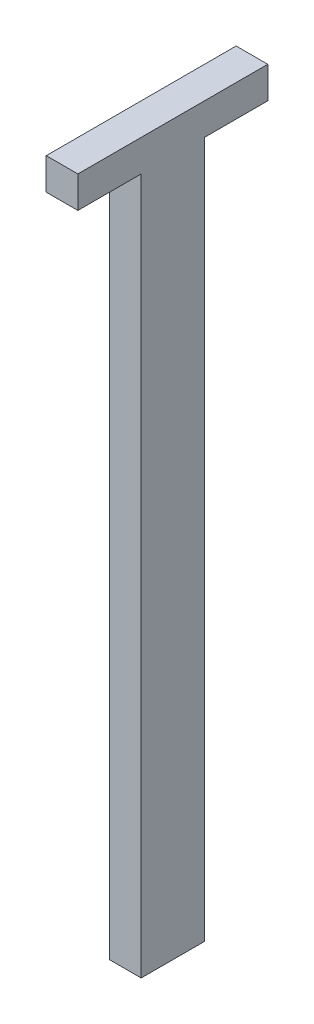
ISO-10303-21;
HEADER;
FILE_DESCRIPTION(('STEP AP214'),'2;1');
FILE_NAME('part.step','',(''),(''),'','','');
FILE_SCHEMA(('AUTOMOTIVE_DESIGN { 1 0 10303 214 1 1 1 1 }'));
ENDSEC;
DATA;
#1=APPLICATION_CONTEXT('core data for automotive mechanical design processes');
#2=APPLICATION_PROTOCOL_DEFINITION('international standard','automotive_design',2000,#1);
#3=PRODUCT_CONTEXT('',#1,'mechanical');
#4=PRODUCT('Part','Part','',(#3));
#5=PRODUCT_RELATED_PRODUCT_CATEGORY('part','',(#4));
#6=PRODUCT_DEFINITION_FORMATION('','',#4);
#7=PRODUCT_DEFINITION_CONTEXT('part definition',#1,'design');
#8=PRODUCT_DEFINITION('design','',#6,#7);
#9=PRODUCT_DEFINITION_SHAPE('','',#8);
#10=(LENGTH_UNIT() NAMED_UNIT(*) SI_UNIT(.MILLI.,.METRE.));
#11=(NAMED_UNIT(*) PLANE_ANGLE_UNIT() SI_UNIT($,.RADIAN.));
#12=(NAMED_UNIT(*) SI_UNIT($,.STERADIAN.) SOLID_ANGLE_UNIT());
#13=UNCERTAINTY_MEASURE_WITH_UNIT(LENGTH_MEASURE(1.E-05),#10,'distance_accuracy_value','');
#14=(GEOMETRIC_REPRESENTATION_CONTEXT(3) GLOBAL_UNCERTAINTY_ASSIGNED_CONTEXT((#13)) GLOBAL_UNIT_ASSIGNED_CONTEXT((#10,
#11,#12)) REPRESENTATION_CONTEXT('',''));
#15=CARTESIAN_POINT('',(0.,0.,0.));
#16=DIRECTION('',(0.,0.,1.));
#17=DIRECTION('',(1.,0.,0.));
#18=AXIS2_PLACEMENT_3D('',#15,#16,#17);
#19=CARTESIAN_POINT('',(0.,110.,0.));
#20=DIRECTION('',(1.,0.,0.));
#21=DIRECTION('',(0.,0.,-1.));
#22=AXIS2_PLACEMENT_3D('',#19,#20,#21);
#23=PLANE('',#22);
#24=DIRECTION('',(0.,0.,1.));
#25=VECTOR('',#24,1.);
#26=CARTESIAN_POINT('',(0.,0.,0.));
#27=LINE('',#26,#25);
#28=CARTESIAN_POINT('',(0.,0.,-9.99999999999999));
#29=VERTEX_POINT('',#28);
#30=CARTESIAN_POINT('',(0.,0.,0.));
#31=VERTEX_POINT('',#30);
#32=EDGE_CURVE('E119',#29,#31,#27,.T.);
#33=ORIENTED_EDGE('',*,*,#32,.T.);
#34=DIRECTION('',(0.,-1.,0.));
#35=VECTOR('',#34,1.);
#36=CARTESIAN_POINT('',(0.,110.,0.));
#37=LINE('',#36,#35);
#38=CARTESIAN_POINT('',(0.,110.,0.));
#39=VERTEX_POINT('',#38);
#40=EDGE_CURVE('E11',#39,#31,#37,.T.);
#41=ORIENTED_EDGE('',*,*,#40,.F.);
#42=DIRECTION('',(0.,0.,-1.));
#43=VECTOR('',#42,1.);
#44=CARTESIAN_POINT('',(0.,110.,0.));
#45=LINE('',#44,#43);
#46=CARTESIAN_POINT('',(0.,110.,10.));
#47=VERTEX_POINT('',#46);
#48=EDGE_CURVE('E116',#47,#39,#45,.T.);
#49=ORIENTED_EDGE('',*,*,#48,.F.);
#50=DIRECTION('',(0.,-1.,0.));
#51=VECTOR('',#50,1.);
#52=CARTESIAN_POINT('',(0.,115.,10.));
#53=LINE('',#52,#51);
#54=CARTESIAN_POINT('',(0.,115.,10.));
#55=VERTEX_POINT('',#54);
#56=EDGE_CURVE('E108',#55,#47,#53,.T.);
#57=ORIENTED_EDGE('',*,*,#56,.F.);
#58=DIRECTION('',(0.,0.,-1.));
#59=VECTOR('',#58,1.);
#60=CARTESIAN_POINT('',(0.,115.,0.));
#61=LINE('',#60,#59);
#62=CARTESIAN_POINT('',(0.,115.,-20.));
#63=VERTEX_POINT('',#62);
#64=EDGE_CURVE('E113',#55,#63,#61,.T.);
#65=ORIENTED_EDGE('',*,*,#64,.T.);
#66=DIRECTION('',(0.,-1.,0.));
#67=VECTOR('',#66,1.);
#68=CARTESIAN_POINT('',(0.,115.,-20.));
#69=LINE('',#68,#67);
#70=CARTESIAN_POINT('',(0.,110.,-20.));
#71=VERTEX_POINT('',#70);
#72=EDGE_CURVE('E141',#63,#71,#69,.T.);
#73=ORIENTED_EDGE('',*,*,#72,.T.);
#74=CARTESIAN_POINT('',(0.,110.,-9.99999999999999));
#75=VERTEX_POINT('',#74);
#76=EDGE_CURVE('E144',#75,#71,#45,.T.);
#77=ORIENTED_EDGE('',*,*,#76,.F.);
#78=DIRECTION('',(0.,-1.,0.));
#79=VECTOR('',#78,1.);
#80=CARTESIAN_POINT('',(0.,110.,-9.99999999999999));
#81=LINE('',#80,#79);
#82=EDGE_CURVE('E158',#75,#29,#81,.T.);
#83=ORIENTED_EDGE('',*,*,#82,.T.);
#84=EDGE_LOOP('',(#33,#41,#49,#57,#65,#73,#77,#83));
#85=FACE_BOUND('',#84,.T.);
#86=ADVANCED_FACE('F37',(#85),#23,.F.);
#87=CARTESIAN_POINT('',(0.,110.,0.));
#88=DIRECTION('',(0.,0.,-1.));
#89=DIRECTION('',(-1.,0.,0.));
#90=AXIS2_PLACEMENT_3D('',#87,#88,#89);
#91=PLANE('',#90);
#92=DIRECTION('',(1.,0.,0.));
#93=VECTOR('',#92,1.);
#94=CARTESIAN_POINT('',(0.,0.,0.));
#95=LINE('',#94,#93);
#96=CARTESIAN_POINT('',(5.,0.,0.));
#97=VERTEX_POINT('',#96);
#98=EDGE_CURVE('E160',#31,#97,#95,.T.);
#99=ORIENTED_EDGE('',*,*,#98,.T.);
#100=DIRECTION('',(0.,-1.,0.));
#101=VECTOR('',#100,1.);
#102=CARTESIAN_POINT('',(5.,110.,0.));
#103=LINE('',#102,#101);
#104=CARTESIAN_POINT('',(5.,110.,0.));
#105=VERTEX_POINT('',#104);
#106=EDGE_CURVE('E45',#105,#97,#103,.T.);
#107=ORIENTED_EDGE('',*,*,#106,.F.);
#108=DIRECTION('',(1.,0.,0.));
#109=VECTOR('',#108,1.);
#110=CARTESIAN_POINT('',(0.,110.,0.));
#111=LINE('',#110,#109);
#112=EDGE_CURVE('E79',#39,#105,#111,.T.);
#113=ORIENTED_EDGE('',*,*,#112,.F.);
#114=ORIENTED_EDGE('',*,*,#40,.T.);
#115=EDGE_LOOP('',(#99,#107,#113,#114));
#116=FACE_BOUND('',#115,.T.);
#117=ADVANCED_FACE('F189',(#116),#91,.F.);
#118=CARTESIAN_POINT('',(5.,110.,0.));
#119=DIRECTION('',(-1.,0.,0.));
#120=DIRECTION('',(0.,0.,1.));
#121=AXIS2_PLACEMENT_3D('',#118,#119,#120);
#122=PLANE('',#121);
#123=DIRECTION('',(0.,0.,-1.));
#124=VECTOR('',#123,1.);
#125=CARTESIAN_POINT('',(5.,0.,0.));
#126=LINE('',#125,#124);
#127=CARTESIAN_POINT('',(5.,0.,-9.99999999999999));
#128=VERTEX_POINT('',#127);
#129=EDGE_CURVE('E69',#97,#128,#126,.T.);
#130=ORIENTED_EDGE('',*,*,#129,.T.);
#131=DIRECTION('',(0.,-1.,0.));
#132=VECTOR('',#131,1.);
#133=CARTESIAN_POINT('',(5.,110.,-9.99999999999999));
#134=LINE('',#133,#132);
#135=CARTESIAN_POINT('',(5.,110.,-9.99999999999999));
#136=VERTEX_POINT('',#135);
#137=EDGE_CURVE('E53',#136,#128,#134,.T.);
#138=ORIENTED_EDGE('',*,*,#137,.F.);
#139=DIRECTION('',(0.,0.,-1.));
#140=VECTOR('',#139,1.);
#141=CARTESIAN_POINT('',(5.,110.,0.));
#142=LINE('',#141,#140);
#143=CARTESIAN_POINT('',(5.,110.,-20.));
#144=VERTEX_POINT('',#143);
#145=EDGE_CURVE('E146',#136,#144,#142,.T.);
#146=ORIENTED_EDGE('',*,*,#145,.T.);
#147=DIRECTION('',(0.,-1.,0.));
#148=VECTOR('',#147,1.);
#149=CARTESIAN_POINT('',(5.,115.,-20.));
#150=LINE('',#149,#148);
#151=CARTESIAN_POINT('',(5.,115.,-20.));
#152=VERTEX_POINT('',#151);
#153=EDGE_CURVE('E150',#152,#144,#150,.T.);
#154=ORIENTED_EDGE('',*,*,#153,.F.);
#155=DIRECTION('',(0.,0.,-1.));
#156=VECTOR('',#155,1.);
#157=CARTESIAN_POINT('',(5.,115.,0.));
#158=LINE('',#157,#156);
#159=CARTESIAN_POINT('',(5.,115.,10.));
#160=VERTEX_POINT('',#159);
#161=EDGE_CURVE('E128',#160,#152,#158,.T.);
#162=ORIENTED_EDGE('',*,*,#161,.F.);
#163=DIRECTION('',(0.,-1.,0.));
#164=VECTOR('',#163,1.);
#165=CARTESIAN_POINT('',(5.,115.,10.));
#166=LINE('',#165,#164);
#167=CARTESIAN_POINT('',(5.,110.,10.));
#168=VERTEX_POINT('',#167);
#169=EDGE_CURVE('E120',#160,#168,#166,.T.);
#170=ORIENTED_EDGE('',*,*,#169,.T.);
#171=EDGE_CURVE('E136',#168,#105,#142,.T.);
#172=ORIENTED_EDGE('',*,*,#171,.T.);
#173=ORIENTED_EDGE('',*,*,#106,.T.);
#174=EDGE_LOOP('',(#130,#138,#146,#154,#162,#170,#172,#173));
#175=FACE_BOUND('',#174,.T.);
#176=ADVANCED_FACE('F165',(#175),#122,.F.);
#177=CARTESIAN_POINT('',(0.,110.,-9.99999999999999));
#178=DIRECTION('',(0.,0.,1.));
#179=DIRECTION('',(1.,0.,0.));
#180=AXIS2_PLACEMENT_3D('',#177,#178,#179);
#181=PLANE('',#180);
#182=DIRECTION('',(-1.,0.,0.));
#183=VECTOR('',#182,1.);
#184=CARTESIAN_POINT('',(0.,0.,-9.99999999999999));
#185=LINE('',#184,#183);
#186=EDGE_CURVE('E74',#128,#29,#185,.T.);
#187=ORIENTED_EDGE('',*,*,#186,.T.);
#188=ORIENTED_EDGE('',*,*,#82,.F.);
#189=DIRECTION('',(-1.,0.,0.));
#190=VECTOR('',#189,1.);
#191=CARTESIAN_POINT('',(0.,110.,-9.99999999999999));
#192=LINE('',#191,#190);
#193=EDGE_CURVE('E155',#136,#75,#192,.T.);
#194=ORIENTED_EDGE('',*,*,#193,.F.);
#195=ORIENTED_EDGE('',*,*,#137,.T.);
#196=EDGE_LOOP('',(#187,#188,#194,#195));
#197=FACE_BOUND('',#196,.T.);
#198=ADVANCED_FACE('F171',(#197),#181,.F.);
#199=CARTESIAN_POINT('',(0.,0.,0.));
#200=DIRECTION('',(0.,-1.,0.));
#201=DIRECTION('',(0.,0.,-1.));
#202=AXIS2_PLACEMENT_3D('',#199,#200,#201);
#203=PLANE('',#202);
#204=ORIENTED_EDGE('',*,*,#32,.F.);
#205=ORIENTED_EDGE('',*,*,#186,.F.);
#206=ORIENTED_EDGE('',*,*,#129,.F.);
#207=ORIENTED_EDGE('',*,*,#98,.F.);
#208=EDGE_LOOP('',(#204,#205,#206,#207));
#209=FACE_BOUND('',#208,.T.);
#210=ADVANCED_FACE('F169',(#209),#203,.T.);
#211=CARTESIAN_POINT('',(0.,110.,0.));
#212=DIRECTION('',(0.,1.,0.));
#213=DIRECTION('',(0.,0.,1.));
#214=AXIS2_PLACEMENT_3D('',#211,#212,#213);
#215=PLANE('',#214);
#216=ORIENTED_EDGE('',*,*,#48,.T.);
#217=ORIENTED_EDGE('',*,*,#112,.T.);
#218=ORIENTED_EDGE('',*,*,#171,.F.);
#219=DIRECTION('',(1.,0.,0.));
#220=VECTOR('',#219,1.);
#221=CARTESIAN_POINT('',(0.,110.,10.));
#222=LINE('',#221,#220);
#223=EDGE_CURVE('E143',#47,#168,#222,.T.);
#224=ORIENTED_EDGE('',*,*,#223,.F.);
#225=EDGE_LOOP('',(#216,#217,#218,#224));
#226=FACE_BOUND('',#225,.T.);
#227=ADVANCED_FACE('F201',(#226),#215,.F.);
#228=ORIENTED_EDGE('',*,*,#145,.F.);
#229=ORIENTED_EDGE('',*,*,#193,.T.);
#230=ORIENTED_EDGE('',*,*,#76,.T.);
#231=DIRECTION('',(1.,0.,0.));
#232=VECTOR('',#231,1.);
#233=CARTESIAN_POINT('',(0.,110.,-20.));
#234=LINE('',#233,#232);
#235=EDGE_CURVE('E133',#71,#144,#234,.T.);
#236=ORIENTED_EDGE('',*,*,#235,.T.);
#237=EDGE_LOOP('',(#228,#229,#230,#236));
#238=FACE_BOUND('',#237,.T.);
#239=ADVANCED_FACE('F174',(#238),#215,.F.);
#240=CARTESIAN_POINT('',(0.,115.,10.));
#241=DIRECTION('',(0.,0.,-1.));
#242=DIRECTION('',(-1.,0.,0.));
#243=AXIS2_PLACEMENT_3D('',#240,#241,#242);
#244=PLANE('',#243);
#245=ORIENTED_EDGE('',*,*,#223,.T.);
#246=ORIENTED_EDGE('',*,*,#169,.F.);
#247=DIRECTION('',(1.,0.,0.));
#248=VECTOR('',#247,1.);
#249=CARTESIAN_POINT('',(0.,115.,10.));
#250=LINE('',#249,#248);
#251=EDGE_CURVE('E123',#55,#160,#250,.T.);
#252=ORIENTED_EDGE('',*,*,#251,.F.);
#253=ORIENTED_EDGE('',*,*,#56,.T.);
#254=EDGE_LOOP('',(#245,#246,#252,#253));
#255=FACE_BOUND('',#254,.T.);
#256=ADVANCED_FACE('F124',(#255),#244,.F.);
#257=CARTESIAN_POINT('',(0.,115.,-20.));
#258=DIRECTION('',(0.,0.,-1.));
#259=DIRECTION('',(-1.,0.,0.));
#260=AXIS2_PLACEMENT_3D('',#257,#258,#259);
#261=PLANE('',#260);
#262=ORIENTED_EDGE('',*,*,#235,.F.);
#263=ORIENTED_EDGE('',*,*,#72,.F.);
#264=DIRECTION('',(1.,0.,0.));
#265=VECTOR('',#264,1.);
#266=CARTESIAN_POINT('',(0.,115.,-20.));
#267=LINE('',#266,#265);
#268=EDGE_CURVE('E132',#63,#152,#267,.T.);
#269=ORIENTED_EDGE('',*,*,#268,.T.);
#270=ORIENTED_EDGE('',*,*,#153,.T.);
#271=EDGE_LOOP('',(#262,#263,#269,#270));
#272=FACE_BOUND('',#271,.T.);
#273=ADVANCED_FACE('F178',(#272),#261,.T.);
#274=CARTESIAN_POINT('',(0.,115.,0.));
#275=DIRECTION('',(0.,1.,0.));
#276=DIRECTION('',(0.,0.,1.));
#277=AXIS2_PLACEMENT_3D('',#274,#275,#276);
#278=PLANE('',#277);
#279=ORIENTED_EDGE('',*,*,#64,.F.);
#280=ORIENTED_EDGE('',*,*,#251,.T.);
#281=ORIENTED_EDGE('',*,*,#161,.T.);
#282=ORIENTED_EDGE('',*,*,#268,.F.);
#283=EDGE_LOOP('',(#279,#280,#281,#282));
#284=FACE_BOUND('',#283,.T.);
#285=ADVANCED_FACE('F130',(#284),#278,.T.);
#286=CLOSED_SHELL('',(#86,#117,#176,#198,#210,#227,#239,#256,#273,#285));
#287=MANIFOLD_SOLID_BREP('B2',#286);
#288=ADVANCED_BREP_SHAPE_REPRESENTATION('',(#18,#287),#14);
#289=SHAPE_DEFINITION_REPRESENTATION(#9,#288);
ENDSEC;
END-ISO-10303-21;
